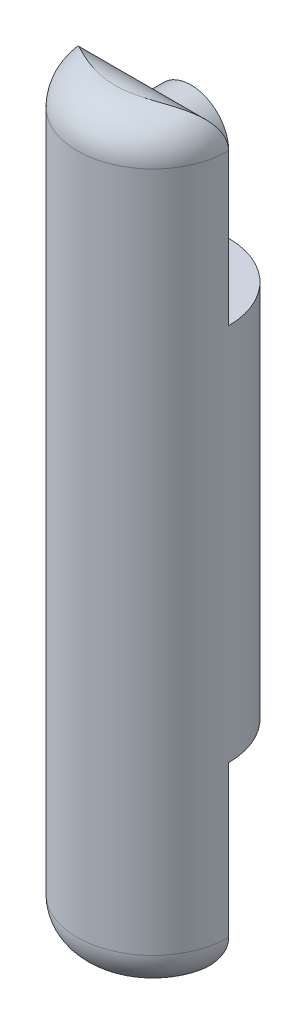
ISO-10303-21;
HEADER;
FILE_DESCRIPTION(('STEP AP214'),'2;1');
FILE_NAME('part.step','',(''),(''),'','','');
FILE_SCHEMA(('AUTOMOTIVE_DESIGN { 1 0 10303 214 1 1 1 1 }'));
ENDSEC;
DATA;
#1=APPLICATION_CONTEXT('core data for automotive mechanical design processes');
#2=APPLICATION_PROTOCOL_DEFINITION('international standard','automotive_design',2000,#1);
#3=PRODUCT_CONTEXT('',#1,'mechanical');
#4=PRODUCT('Part','Part','',(#3));
#5=PRODUCT_RELATED_PRODUCT_CATEGORY('part','',(#4));
#6=PRODUCT_DEFINITION_FORMATION('','',#4);
#7=PRODUCT_DEFINITION_CONTEXT('part definition',#1,'design');
#8=PRODUCT_DEFINITION('design','',#6,#7);
#9=PRODUCT_DEFINITION_SHAPE('','',#8);
#10=(LENGTH_UNIT() NAMED_UNIT(*) SI_UNIT(.MILLI.,.METRE.));
#11=(NAMED_UNIT(*) PLANE_ANGLE_UNIT() SI_UNIT($,.RADIAN.));
#12=(NAMED_UNIT(*) SI_UNIT($,.STERADIAN.) SOLID_ANGLE_UNIT());
#13=UNCERTAINTY_MEASURE_WITH_UNIT(LENGTH_MEASURE(1.E-05),#10,'distance_accuracy_value','');
#14=(GEOMETRIC_REPRESENTATION_CONTEXT(3) GLOBAL_UNCERTAINTY_ASSIGNED_CONTEXT((#13)) GLOBAL_UNIT_ASSIGNED_CONTEXT((#10,
#11,#12)) REPRESENTATION_CONTEXT('',''));
#15=CARTESIAN_POINT('',(0.,0.,0.));
#16=DIRECTION('',(0.,0.,1.));
#17=DIRECTION('',(1.,0.,0.));
#18=AXIS2_PLACEMENT_3D('',#15,#16,#17);
#19=CARTESIAN_POINT('',(0.,100.,0.));
#20=DIRECTION('',(0.,-1.,0.));
#21=DIRECTION('',(0.,0.,-1.));
#22=AXIS2_PLACEMENT_3D('',#19,#20,#21);
#23=CYLINDRICAL_SURFACE('',#22,10.);
#24=DIRECTION('',(0.,1.,0.));
#25=VECTOR('',#24,1.);
#26=CARTESIAN_POINT('',(10.,75.,0.));
#27=LINE('',#26,#25);
#28=CARTESIAN_POINT('',(10.,75.,0.));
#29=VERTEX_POINT('',#28);
#30=CARTESIAN_POINT('',(10.,95.,0.));
#31=VERTEX_POINT('',#30);
#32=EDGE_CURVE('E216',#29,#31,#27,.T.);
#33=ORIENTED_EDGE('',*,*,#32,.T.);
#34=CARTESIAN_POINT('',(0.,95.,0.));
#35=DIRECTION('',(0.,1.,0.));
#36=DIRECTION('',(0.,0.,1.));
#37=AXIS2_PLACEMENT_3D('',#34,#35,#36);
#38=CIRCLE('',#37,10.);
#39=CARTESIAN_POINT('',(-10.,95.,0.));
#40=VERTEX_POINT('',#39);
#41=EDGE_CURVE('E208',#31,#40,#38,.F.);
#42=ORIENTED_EDGE('',*,*,#41,.T.);
#43=DIRECTION('',(0.,-1.,0.));
#44=VECTOR('',#43,1.);
#45=CARTESIAN_POINT('',(-10.,75.,0.));
#46=LINE('',#45,#44);
#47=CARTESIAN_POINT('',(-10.,75.,0.));
#48=VERTEX_POINT('',#47);
#49=EDGE_CURVE('E224',#40,#48,#46,.T.);
#50=ORIENTED_EDGE('',*,*,#49,.T.);
#51=CARTESIAN_POINT('',(0.,75.,0.));
#52=DIRECTION('',(0.,-1.,0.));
#53=DIRECTION('',(0.,0.,-1.));
#54=AXIS2_PLACEMENT_3D('',#51,#52,#53);
#55=CIRCLE('',#54,10.);
#56=EDGE_CURVE('E212',#48,#29,#55,.T.);
#57=ORIENTED_EDGE('',*,*,#56,.T.);
#58=EDGE_LOOP('',(#33,#42,#50,#57));
#59=FACE_BOUND('',#58,.T.);
#60=DIRECTION('',(0.,1.,0.));
#61=VECTOR('',#60,1.);
#62=CARTESIAN_POINT('',(-10.,25.,0.));
#63=LINE('',#62,#61);
#64=CARTESIAN_POINT('',(-10.,4.99999999999998,0.));
#65=VERTEX_POINT('',#64);
#66=CARTESIAN_POINT('',(-10.,25.,0.));
#67=VERTEX_POINT('',#66);
#68=EDGE_CURVE('E240',#65,#67,#63,.T.);
#69=ORIENTED_EDGE('',*,*,#68,.F.);
#70=CARTESIAN_POINT('',(0.,4.99999999999998,0.));
#71=DIRECTION('',(0.,1.,0.));
#72=DIRECTION('',(0.,0.,1.));
#73=AXIS2_PLACEMENT_3D('',#70,#71,#72);
#74=CIRCLE('',#73,10.);
#75=CARTESIAN_POINT('',(10.,4.99999999999998,0.));
#76=VERTEX_POINT('',#75);
#77=EDGE_CURVE('E11',#65,#76,#74,.T.);
#78=ORIENTED_EDGE('',*,*,#77,.T.);
#79=DIRECTION('',(0.,-1.,0.));
#80=VECTOR('',#79,1.);
#81=CARTESIAN_POINT('',(10.,25.,0.));
#82=LINE('',#81,#80);
#83=CARTESIAN_POINT('',(10.,25.,0.));
#84=VERTEX_POINT('',#83);
#85=EDGE_CURVE('E237',#84,#76,#82,.T.);
#86=ORIENTED_EDGE('',*,*,#85,.F.);
#87=CARTESIAN_POINT('',(0.,25.,0.));
#88=DIRECTION('',(0.,-1.,0.));
#89=DIRECTION('',(0.,0.,-1.));
#90=AXIS2_PLACEMENT_3D('',#87,#88,#89);
#91=CIRCLE('',#90,10.);
#92=EDGE_CURVE('E107',#67,#84,#91,.T.);
#93=ORIENTED_EDGE('',*,*,#92,.F.);
#94=EDGE_LOOP('',(#69,#78,#86,#93));
#95=FACE_BOUND('',#94,.T.);
#96=ADVANCED_FACE('F45',(#59,#95),#23,.T.);
#97=CARTESIAN_POINT('',(10.,75.,-10.));
#98=DIRECTION('',(0.,-1.,0.));
#99=DIRECTION('',(0.,0.,-1.));
#100=AXIS2_PLACEMENT_3D('',#97,#98,#99);
#101=PLANE('',#100);
#102=ORIENTED_EDGE('',*,*,#56,.F.);
#103=DIRECTION('',(1.,0.,0.));
#104=VECTOR('',#103,1.);
#105=CARTESIAN_POINT('',(10.,75.,0.));
#106=LINE('',#105,#104);
#107=EDGE_CURVE('E220',#48,#29,#106,.T.);
#108=ORIENTED_EDGE('',*,*,#107,.T.);
#109=EDGE_LOOP('',(#102,#108));
#110=FACE_BOUND('',#109,.T.);
#111=ADVANCED_FACE('F256',(#110),#101,.F.);
#112=CARTESIAN_POINT('',(0.,0.,0.));
#113=DIRECTION('',(0.,0.,1.));
#114=DIRECTION('',(1.,0.,0.));
#115=AXIS2_PLACEMENT_3D('',#112,#113,#114);
#116=PLANE('',#115);
#117=ORIENTED_EDGE('',*,*,#49,.F.);
#118=DIRECTION('',(-1.,0.,0.));
#119=VECTOR('',#118,1.);
#120=CARTESIAN_POINT('',(10.,95.,0.));
#121=LINE('',#120,#119);
#122=CARTESIAN_POINT('',(-0.812574400381942,95.,0.));
#123=VERTEX_POINT('',#122);
#124=EDGE_CURVE('E202',#40,#123,#121,.F.);
#125=ORIENTED_EDGE('',*,*,#124,.T.);
#126=CARTESIAN_POINT('',(0.,90.066469535531,0.));
#127=DIRECTION('',(0.,0.,1.));
#128=DIRECTION('',(1.,0.,0.));
#129=AXIS2_PLACEMENT_3D('',#126,#127,#128);
#130=CIRCLE('',#129,5.);
#131=CARTESIAN_POINT('',(0.812574400381942,95.,0.));
#132=VERTEX_POINT('',#131);
#133=EDGE_CURVE('E159',#123,#132,#130,.T.);
#134=ORIENTED_EDGE('',*,*,#133,.T.);
#135=DIRECTION('',(-1.,0.,0.));
#136=VECTOR('',#135,1.);
#137=CARTESIAN_POINT('',(10.,95.,0.));
#138=LINE('',#137,#136);
#139=EDGE_CURVE('E205',#132,#31,#138,.F.);
#140=ORIENTED_EDGE('',*,*,#139,.T.);
#141=ORIENTED_EDGE('',*,*,#32,.F.);
#142=ORIENTED_EDGE('',*,*,#107,.F.);
#143=EDGE_LOOP('',(#117,#125,#134,#140,#141,#142));
#144=FACE_BOUND('',#143,.T.);
#145=ADVANCED_FACE('F193',(#144),#116,.F.);
#146=CARTESIAN_POINT('',(0.,90.066469535531,-5.));
#147=DIRECTION('',(0.,0.,1.));
#148=DIRECTION('',(1.,0.,0.));
#149=AXIS2_PLACEMENT_3D('',#146,#147,#148);
#150=CYLINDRICAL_SURFACE('',#149,5.);
#151=CARTESIAN_POINT('',(0.,90.066469535531,-5.));
#152=DIRECTION('',(0.,0.,1.));
#153=DIRECTION('',(1.,0.,0.));
#154=AXIS2_PLACEMENT_3D('',#151,#152,#153);
#155=CIRCLE('',#154,5.);
#156=CARTESIAN_POINT('',(5.,90.066469535531,-5.));
#157=VERTEX_POINT('',#156);
#158=EDGE_CURVE('E227',#157,#157,#155,.T.);
#159=ORIENTED_EDGE('',*,*,#158,.T.);
#160=EDGE_LOOP('',(#159));
#161=FACE_BOUND('',#160,.T.);
#162=ORIENTED_EDGE('',*,*,#133,.F.);
#163=CARTESIAN_POINT('',(-0.812574400381942,95.,0.));
#164=CARTESIAN_POINT('',(-0.67790557342769,95.0221930891362,3.66883130780384E-05));
#165=CARTESIAN_POINT('',(-0.542326520837233,95.0388472944748,0.000147760704351347));
#166=CARTESIAN_POINT('',(-0.271160991618298,95.0609488182908,0.000350273768121055));
#167=CARTESIAN_POINT('',(-0.135580495809148,95.066469535531,0.000441839434129433));
#168=CARTESIAN_POINT('',(0.13558049580915,95.066469535531,0.000441839434129461));
#169=CARTESIAN_POINT('',(0.2711609916183,95.0609488182908,0.00035027376812111));
#170=CARTESIAN_POINT('',(0.542326520837235,95.0388472944748,0.000147760704351463));
#171=CARTESIAN_POINT('',(0.677905573427692,95.0221930891362,3.66883130781877E-05));
#172=CARTESIAN_POINT('',(0.812574400381944,95.,0.));
#173=B_SPLINE_CURVE_WITH_KNOTS('',3,(#163,#164,#165,#166,#167,#168,#169,#170,#171,#172),
.UNSPECIFIED.,.F.,.F.,(4,2,2,2,4),(0.,0.409337772377737,0.815968000251602,1.22259822812547,
1.6319360005032),.UNSPECIFIED.);
#174=EDGE_CURVE('E163',#123,#132,#173,.T.);
#175=ORIENTED_EDGE('',*,*,#174,.T.);
#176=EDGE_LOOP('',(#162,#175));
#177=FACE_BOUND('',#176,.T.);
#178=ADVANCED_FACE('F188',(#161,#177),#150,.T.);
#179=CARTESIAN_POINT('',(0.,90.066469535531,-5.));
#180=DIRECTION('',(0.,0.,1.));
#181=DIRECTION('',(1.,0.,0.));
#182=AXIS2_PLACEMENT_3D('',#179,#180,#181);
#183=PLANE('',#182);
#184=ORIENTED_EDGE('',*,*,#158,.F.);
#185=EDGE_LOOP('',(#184));
#186=FACE_BOUND('',#185,.T.);
#187=ADVANCED_FACE('F185',(#186),#183,.F.);
#188=CARTESIAN_POINT('',(0.,95.,5.));
#189=DIRECTION('',(1.,0.,0.));
#190=DIRECTION('',(0.,0.,-1.));
#191=AXIS2_PLACEMENT_3D('',#188,#189,#190);
#192=CYLINDRICAL_SURFACE('',#191,5.);
#193=ORIENTED_EDGE('',*,*,#174,.F.);
#194=ORIENTED_EDGE('',*,*,#124,.F.);
#195=CARTESIAN_POINT('',(-10.,95.,0.));
#196=CARTESIAN_POINT('',(-10.0000186621462,95.109481128906,-2.67095448372106E-05));
#197=CARTESIAN_POINT('',(-9.99640510464395,95.2189487809777,0.00359468229512016));
#198=CARTESIAN_POINT('',(-9.98205407947085,95.436887226979,0.0179345321929953));
#199=CARTESIAN_POINT('',(-9.97132069824936,95.5453585565659,0.0286489191928138));
#200=CARTESIAN_POINT('',(-9.94296936316064,95.7597128234585,0.0568773691555696));
#201=CARTESIAN_POINT('',(-9.9253998926326,95.8656085286161,0.0743435411466067));
#202=CARTESIAN_POINT('',(-9.88362272288509,96.0748003444367,0.115722034743118));
#203=CARTESIAN_POINT('',(-9.85941439914113,96.178096209531,0.139634962798709));
#204=CARTESIAN_POINT('',(-9.80472959176057,96.3811629860674,0.193401065176742));
#205=CARTESIAN_POINT('',(-9.77426730480449,96.4809412916891,0.223240780610438));
#206=CARTESIAN_POINT('',(-9.707403231472,96.6766699717462,0.28837204733803));
#207=CARTESIAN_POINT('',(-9.67099881241379,96.7726186258839,0.323666014786202));
#208=CARTESIAN_POINT('',(-9.5533328841649,97.0542415608907,0.436999216654399));
#209=CARTESIAN_POINT('',(-9.46365532149096,97.2335590300103,0.522453277561387));
#210=CARTESIAN_POINT('',(-9.29879424318218,97.5153010191273,0.676836950648343));
#211=CARTESIAN_POINT('',(-9.22891680346262,97.6232678349325,0.741625025645634));
#212=CARTESIAN_POINT('',(-9.08164924199558,97.8304836258159,0.876454251929069));
#213=CARTESIAN_POINT('',(-9.00425709687325,97.9297302391538,0.946496816854011));
#214=CARTESIAN_POINT('',(-8.76185518300568,98.2144481017106,1.16279508776863));
#215=CARTESIAN_POINT('',(-8.5866781068222,98.3868001635109,1.31516605491869));
#216=CARTESIAN_POINT('',(-8.27203822653394,98.6501577584139,1.57950470468883));
#217=CARTESIAN_POINT('',(-8.13803760630387,98.7499210627327,1.68957734990039));
#218=CARTESIAN_POINT('',(-7.86104722004844,98.9344377621682,1.91115476753484));
#219=CARTESIAN_POINT('',(-7.71805401740357,99.0191853710499,2.0226600743532));
#220=CARTESIAN_POINT('',(-7.42409710519104,99.174886719524,2.24522141218175));
#221=CARTESIAN_POINT('',(-7.27312197218609,99.2458199696341,2.35627654017932));
#222=CARTESIAN_POINT('',(-6.96431462329925,99.3750429806096,2.57610843955653));
#223=CARTESIAN_POINT('',(-6.8064826711737,99.4333332272884,2.68488529833457));
#224=CARTESIAN_POINT('',(-6.4333751897412,99.5553855198772,2.93283423400923));
#225=CARTESIAN_POINT('',(-6.21582430709963,99.6149701922133,3.07064395790101));
#226=CARTESIAN_POINT('',(-5.77134687809699,99.7175177765771,3.3370492171827));
#227=CARTESIAN_POINT('',(-5.54441734026438,99.7604753391232,3.46564177628678));
#228=CARTESIAN_POINT('',(-5.08241188023016,99.8327165244243,3.71112074230516));
#229=CARTESIAN_POINT('',(-4.84734108268232,99.8620085869544,3.82801433933006));
#230=CARTESIAN_POINT('',(-4.36990210844634,99.9098326852446,4.04804635997963));
#231=CARTESIAN_POINT('',(-4.12753655342137,99.9283685392358,4.15118965464965));
#232=CARTESIAN_POINT('',(-3.63869429345518,99.9572960234078,4.34095196067851));
#233=CARTESIAN_POINT('',(-3.39228155020723,99.9677660337299,4.42772365063253));
#234=CARTESIAN_POINT('',(-2.89421757355262,99.9833068989249,4.5842745680929));
#235=CARTESIAN_POINT('',(-2.64257154616481,99.9883828802061,4.65406988096091));
#236=CARTESIAN_POINT('',(-2.07767772316836,99.996106694137,4.78899146958065));
#237=CARTESIAN_POINT('',(-1.76330130773517,99.9979519341869,4.84953927754232));
#238=CARTESIAN_POINT('',(-1.24917414857425,99.999499250028,4.92393586920952));
#239=CARTESIAN_POINT('',(-1.05068743231913,99.9997457724766,4.94678266441202));
#240=CARTESIAN_POINT('',(-0.72996052556808,99.9999435027498,4.97409886461233));
#241=CARTESIAN_POINT('',(-0.608031310894953,99.9999721984027,4.98225936203668));
#242=CARTESIAN_POINT('',(-0.413828993335563,99.9999942465566,4.99169777967294));
#243=CARTESIAN_POINT('',(-0.341624193407272,99.999997249708,4.99442549880829));
#244=CARTESIAN_POINT('',(-0.212942289660993,99.9999998037038,4.99789212412415));
#245=CARTESIAN_POINT('',(-0.15647337716182,99.999999965158,4.9989352311098));
#246=CARTESIAN_POINT('',(-0.0666676462309068,99.9999999808091,4.99983334427297));
#247=CARTESIAN_POINT('',(-0.0333337370939474,99.9999999338005,5.00000004848213));
#248=CARTESIAN_POINT('',(0.,100.,5.00000000000003));
#249=B_SPLINE_CURVE_WITH_KNOTS('',3,(#195,#196,#197,#198,#199,#200,#201,#202,#203,#204,#205,
#206,#207,#208,#209,#210,#211,#212,#213,#214,#215,#216,#217,#218,#219,#220,#221,#222,#223,#224,
#225,#226,#227,#228,#229,#230,#231,#232,#233,#234,#235,#236,#237,#238,#239,#240,#241,#242,#243,
#244,#245,#246,#247,#248),.UNSPECIFIED.,.F.,.F.,(4,2,2,2,2,2,2,2,2,2,2,2,2,2,2,2,2,2,2,2,2,2,2,
2,2,2,4),(0.,0.328302730117657,0.656417192510453,0.982245796518992,1.30810506211666,
1.63323263819663,1.95850465611579,2.60947408305884,3.04098213308044,3.47260669285976,
4.33622925737949,4.93572989894279,5.53546105549433,6.13607507084202,6.73666600322207,
7.52867879459255,8.32094619082361,9.1127236350197,9.90421984242299,10.6879240924535,
11.4708828531573,12.4298889508044,13.0289555962828,13.3954793452464,13.612232508259,
13.7816597364275,13.8816609864198),.UNSPECIFIED.);
#250=CARTESIAN_POINT('',(0.,100.,5.));
#251=VERTEX_POINT('',#250);
#252=EDGE_CURVE('E152',#251,#40,#249,.F.);
#253=ORIENTED_EDGE('',*,*,#252,.F.);
#254=CARTESIAN_POINT('',(0.,100.,5.00000000000003));
#255=CARTESIAN_POINT('',(0.0333342246904434,99.9999999919485,5.00000000062013));
#256=CARTESIAN_POINT('',(0.0666679318382451,100.000000009193,4.99983331950454));
#257=CARTESIAN_POINT('',(0.11194429202892,99.9999999627472,4.99938055749996));
#258=CARTESIAN_POINT('',(0.123888373596873,99.9999999438894,4.99923971709066));
#259=CARTESIAN_POINT('',(0.183608620272589,99.9999997989185,4.99842851985548));
#260=CARTESIAN_POINT('',(0.231380854224731,99.9999995207598,4.99743720782266));
#261=CARTESIAN_POINT('',(0.327822840911283,99.9999974234562,4.99474509388247));
#262=CARTESIAN_POINT('',(0.376492223332792,99.9999955748401,4.99303104100167));
#263=CARTESIAN_POINT('',(0.450934898986961,99.9999898487715,4.98986613856566));
#264=CARTESIAN_POINT('',(0.476719305099431,99.9999873330636,4.98867015770637));
#265=CARTESIAN_POINT('',(0.605628485689679,99.9999709676357,4.9821925199474));
#266=CARTESIAN_POINT('',(0.708680289859203,99.9999457589226,4.97541903753608));
#267=CARTESIAN_POINT('',(1.01784248879754,99.9997828571157,4.95032502497093));
#268=CARTESIAN_POINT('',(1.22358537445785,99.9995576640486,4.92723825641113));
#269=CARTESIAN_POINT('',(1.63342690119004,99.9983600344552,4.86869876846174));
#270=CARTESIAN_POINT('',(1.83752419911383,99.9973870398291,4.83323682401451));
#271=CARTESIAN_POINT('',(2.34405286043905,99.9930875369004,4.72987559488323));
#272=CARTESIAN_POINT('',(2.64500081144544,99.9888324467156,4.65461280939048));
#273=CARTESIAN_POINT('',(3.23969663258352,99.9736216406297,4.47964559384549));
#274=CARTESIAN_POINT('',(3.53343942059888,99.9626613290149,4.37992442829221));
#275=CARTESIAN_POINT('',(4.11257118853161,99.9299576254203,4.15853862402556));
#276=CARTESIAN_POINT('',(4.3979428378552,99.9081933343874,4.03683174788168));
#277=CARTESIAN_POINT('',(4.95831241644302,99.8493945392217,3.77468044275884));
#278=CARTESIAN_POINT('',(5.23331220221517,99.8123627821781,3.63423938771124));
#279=CARTESIAN_POINT('',(5.70277195713379,99.7303037813628,3.37592942545357));
#280=CARTESIAN_POINT('',(5.89988110128237,99.6897263547158,3.26144223521077));
#281=CARTESIAN_POINT('',(6.28681434994671,99.5954477346053,3.02566911424512));
#282=CARTESIAN_POINT('',(6.47663821465877,99.5417461095711,2.904382960049));
#283=CARTESIAN_POINT('',(6.84763717279321,99.4193105142843,2.657209181453));
#284=CARTESIAN_POINT('',(7.02883169395037,99.3506124651626,2.53133314136388));
#285=CARTESIAN_POINT('',(7.38184229370282,99.196104710065,2.27697873907008));
#286=CARTESIAN_POINT('',(7.55365964047622,99.1102973253128,2.14850073199631));
#287=CARTESIAN_POINT('',(7.95008958438294,98.8831364050198,1.84244258513636));
#288=CARTESIAN_POINT('',(8.16983186428416,98.7330812496108,1.66483209803055));
#289=CARTESIAN_POINT('',(8.58323482390857,98.3920074196377,1.31853681797523));
#290=CARTESIAN_POINT('',(8.77692328366495,98.2010329482229,1.14984263640582));
#291=CARTESIAN_POINT('',(9.09285473514287,97.8215872031395,0.866968422252701));
#292=CARTESIAN_POINT('',(9.22150334687803,97.641418327926,0.748868635196722));
#293=CARTESIAN_POINT('',(9.45380103481113,97.2551100622395,0.531956521522456));
#294=CARTESIAN_POINT('',(9.55747462820606,97.0489964461161,0.433125297884917));
#295=CARTESIAN_POINT('',(9.72154772342875,96.6469157285514,0.274861264411679));
#296=CARTESIAN_POINT('',(9.78612438703671,96.4541451985123,0.211727452652631));
#297=CARTESIAN_POINT('',(9.86474352404259,96.1559755637524,0.134375287583743));
#298=CARTESIAN_POINT('',(9.88790464516985,96.0551154874339,0.111486992878856));
#299=CARTESIAN_POINT('',(9.92790705749827,95.8509772906148,0.0718531712626069));
#300=CARTESIAN_POINT('',(9.94475070771367,95.7477000880317,0.0551053514818556));
#301=CARTESIAN_POINT('',(9.97214835117934,95.5374817981561,0.0278229570266679));
#302=CARTESIAN_POINT('',(9.98257742794377,95.4305083559682,0.0174118201305885));
#303=CARTESIAN_POINT('',(9.99651089353284,95.2156944435843,0.00348892643664454));
#304=CARTESIAN_POINT('',(10.0000170188917,95.1078541976313,-2.4560547630878E-05));
#305=CARTESIAN_POINT('',(10.,95.,0.));
#306=B_SPLINE_CURVE_WITH_KNOTS('',3,(#254,#255,#256,#257,#258,#259,#260,#261,#262,#263,#264,
#265,#266,#267,#268,#269,#270,#271,#272,#273,#274,#275,#276,#277,#278,#279,#280,#281,#282,#283,
#284,#285,#286,#287,#288,#289,#290,#291,#292,#293,#294,#295,#296,#297,#298,#299,#300,#301,#302,
#303,#304,#305),.UNSPECIFIED.,.F.,.F.,(4,2,2,2,2,2,2,2,2,2,2,2,2,2,2,2,2,2,2,2,2,2,2,2,2,4),(0.,
0.100001249992197,0.135835934097826,0.279178118292439,0.42527123528673,0.502707092721602,
0.812484968795602,1.43316188447759,2.05430247475667,2.98380240403824,3.9139401211723,
4.84588413513619,5.77766053669958,6.47173074753722,7.16582378496708,7.85827214717592,
8.55062662875167,9.50715874425213,10.462662727695,11.2125799031296,11.9617578806476,
12.59739247633,12.9150162436145,13.2325212882739,13.5560283356812,13.8794542251495),.UNSPECIFIED.);
#307=EDGE_CURVE('E145',#31,#251,#306,.F.);
#308=ORIENTED_EDGE('',*,*,#307,.F.);
#309=ORIENTED_EDGE('',*,*,#139,.F.);
#310=EDGE_LOOP('',(#193,#194,#253,#308,#309));
#311=FACE_BOUND('',#310,.T.);
#312=ADVANCED_FACE('F139',(#311),#192,.T.);
#313=CARTESIAN_POINT('',(0.,95.,0.));
#314=DIRECTION('',(0.,1.,0.));
#315=DIRECTION('',(0.,0.,1.));
#316=AXIS2_PLACEMENT_3D('',#313,#314,#315);
#317=DEGENERATE_TOROIDAL_SURFACE('',#316,5.,5.,.T.);
#318=ORIENTED_EDGE('',*,*,#252,.T.);
#319=ORIENTED_EDGE('',*,*,#41,.F.);
#320=ORIENTED_EDGE('',*,*,#307,.T.);
#321=EDGE_LOOP('',(#318,#319,#320));
#322=FACE_BOUND('',#321,.T.);
#323=ADVANCED_FACE('F133',(#322),#317,.T.);
#324=CARTESIAN_POINT('',(10.,25.,-10.));
#325=DIRECTION('',(0.,-1.,0.));
#326=DIRECTION('',(0.,0.,-1.));
#327=AXIS2_PLACEMENT_3D('',#324,#325,#326);
#328=PLANE('',#327);
#329=ORIENTED_EDGE('',*,*,#92,.T.);
#330=DIRECTION('',(1.,0.,0.));
#331=VECTOR('',#330,1.);
#332=CARTESIAN_POINT('',(10.,25.,0.));
#333=LINE('',#332,#331);
#334=EDGE_CURVE('E234',#67,#84,#333,.T.);
#335=ORIENTED_EDGE('',*,*,#334,.F.);
#336=EDGE_LOOP('',(#329,#335));
#337=FACE_BOUND('',#336,.T.);
#338=ADVANCED_FACE('F138',(#337),#328,.T.);
#339=CARTESIAN_POINT('',(0.,100.,0.));
#340=DIRECTION('',(0.,0.,1.));
#341=DIRECTION('',(1.,0.,0.));
#342=AXIS2_PLACEMENT_3D('',#339,#340,#341);
#343=PLANE('',#342);
#344=ORIENTED_EDGE('',*,*,#85,.T.);
#345=DIRECTION('',(-1.,0.,0.));
#346=VECTOR('',#345,1.);
#347=CARTESIAN_POINT('',(0.,5.,0.));
#348=LINE('',#347,#346);
#349=CARTESIAN_POINT('',(0.812574400382033,5.,0.));
#350=VERTEX_POINT('',#349);
#351=EDGE_CURVE('E118',#76,#350,#348,.T.);
#352=ORIENTED_EDGE('',*,*,#351,.T.);
#353=CARTESIAN_POINT('',(0.,9.93353046446902,0.));
#354=DIRECTION('',(0.,0.,1.));
#355=DIRECTION('',(1.,0.,0.));
#356=AXIS2_PLACEMENT_3D('',#353,#354,#355);
#357=CIRCLE('',#356,5.);
#358=CARTESIAN_POINT('',(-0.812574400382033,5.,0.));
#359=VERTEX_POINT('',#358);
#360=EDGE_CURVE('E121',#350,#359,#357,.T.);
#361=ORIENTED_EDGE('',*,*,#360,.T.);
#362=DIRECTION('',(-1.,0.,0.));
#363=VECTOR('',#362,1.);
#364=CARTESIAN_POINT('',(0.,5.,0.));
#365=LINE('',#364,#363);
#366=EDGE_CURVE('E162',#359,#65,#365,.T.);
#367=ORIENTED_EDGE('',*,*,#366,.T.);
#368=ORIENTED_EDGE('',*,*,#68,.T.);
#369=ORIENTED_EDGE('',*,*,#334,.T.);
#370=EDGE_LOOP('',(#344,#352,#361,#367,#368,#369));
#371=FACE_BOUND('',#370,.T.);
#372=ADVANCED_FACE('F178',(#371),#343,.F.);
#373=CARTESIAN_POINT('',(0.,9.93353046446902,5.));
#374=DIRECTION('',(0.,0.,-1.));
#375=DIRECTION('',(-1.,0.,0.));
#376=AXIS2_PLACEMENT_3D('',#373,#374,#375);
#377=CYLINDRICAL_SURFACE('',#376,5.);
#378=CARTESIAN_POINT('',(0.,9.93353046446902,5.));
#379=DIRECTION('',(0.,0.,1.));
#380=DIRECTION('',(1.,0.,0.));
#381=AXIS2_PLACEMENT_3D('',#378,#379,#380);
#382=CIRCLE('',#381,5.);
#383=CARTESIAN_POINT('',(5.,9.93353046446902,5.));
#384=VERTEX_POINT('',#383);
#385=EDGE_CURVE('E243',#384,#384,#382,.T.);
#386=ORIENTED_EDGE('',*,*,#385,.T.);
#387=EDGE_LOOP('',(#386));
#388=FACE_BOUND('',#387,.T.);
#389=ORIENTED_EDGE('',*,*,#360,.F.);
#390=CARTESIAN_POINT('',(0.812574400382033,5.,0.));
#391=CARTESIAN_POINT('',(0.677905573427767,4.9778069108638,3.66883130779067E-05));
#392=CARTESIAN_POINT('',(0.542326520837294,4.96115270552516,0.000147760704351183));
#393=CARTESIAN_POINT('',(0.271160991618329,4.93905118170922,0.000350273768120873));
#394=CARTESIAN_POINT('',(0.135580495809164,4.93353046446901,0.000441839434129264));
#395=CARTESIAN_POINT('',(-0.135580495809165,4.93353046446901,0.000441839434129214));
#396=CARTESIAN_POINT('',(-0.271160991618329,4.93905118170922,0.000350273768120773));
#397=CARTESIAN_POINT('',(-0.542326520837294,4.96115270552516,0.000147760704350984));
#398=CARTESIAN_POINT('',(-0.677905573427767,4.9778069108638,3.66883130776581E-05));
#399=CARTESIAN_POINT('',(-0.812574400382033,5.00000000000001,0.));
#400=B_SPLINE_CURVE_WITH_KNOTS('',3,(#390,#391,#392,#393,#394,#395,#396,#397,#398,#399),
.UNSPECIFIED.,.F.,.F.,(4,2,2,2,4),(0.,0.409337772377784,0.815968000251694,1.2225982281256,
1.63193600050339),.UNSPECIFIED.);
#401=EDGE_CURVE('E61',#350,#359,#400,.T.);
#402=ORIENTED_EDGE('',*,*,#401,.T.);
#403=EDGE_LOOP('',(#389,#402));
#404=FACE_BOUND('',#403,.T.);
#405=ADVANCED_FACE('F173',(#388,#404),#377,.F.);
#406=CARTESIAN_POINT('',(0.,9.93353046446902,5.));
#407=DIRECTION('',(0.,0.,1.));
#408=DIRECTION('',(1.,0.,0.));
#409=AXIS2_PLACEMENT_3D('',#406,#407,#408);
#410=PLANE('',#409);
#411=ORIENTED_EDGE('',*,*,#385,.F.);
#412=EDGE_LOOP('',(#411));
#413=FACE_BOUND('',#412,.T.);
#414=ADVANCED_FACE('F132',(#413),#410,.F.);
#415=CARTESIAN_POINT('',(0.,5.,0.));
#416=DIRECTION('',(0.,1.,0.));
#417=DIRECTION('',(0.,0.,1.));
#418=AXIS2_PLACEMENT_3D('',#415,#416,#417);
#419=DEGENERATE_TOROIDAL_SURFACE('',#418,5.,5.,.T.);
#420=CARTESIAN_POINT('',(0.,0.,5.00000000000003));
#421=CARTESIAN_POINT('',(0.0333342246904454,8.05146995597153E-09,5.0000000006201));
#422=CARTESIAN_POINT('',(0.0666679318382503,-9.19288872753277E-09,4.99983331950453));
#423=CARTESIAN_POINT('',(0.111944292028923,3.72527662451889E-08,4.99938055749996));
#424=CARTESIAN_POINT('',(0.123888373596871,5.61105470790103E-08,4.99923971709066));
#425=CARTESIAN_POINT('',(0.18360862027256,2.01081495268737E-07,4.99842851985547));
#426=CARTESIAN_POINT('',(0.231380854224678,4.79240227690847E-07,4.9974372078226));
#427=CARTESIAN_POINT('',(0.327822840911183,2.57654382951673E-06,4.99474509388253));
#428=CARTESIAN_POINT('',(0.37649222333267,4.42515988476219E-06,4.99303104100191));
#429=CARTESIAN_POINT('',(0.450934898986761,1.01512285160947E-05,4.98986613856591));
#430=CARTESIAN_POINT('',(0.476719305099183,1.26669363584032E-05,4.98867015770657));
#431=CARTESIAN_POINT('',(0.605628485689189,2.9032364293388E-05,4.98219251994743));
#432=CARTESIAN_POINT('',(0.708680289858526,5.42410773670138E-05,4.97541903753613));
#433=CARTESIAN_POINT('',(1.0178424887963,0.000217142884288431,4.95032502497105));
#434=CARTESIAN_POINT('',(1.22358537445623,0.000442335951445316,4.92723825641131));
#435=CARTESIAN_POINT('',(1.6334269011877,0.00163996554475022,4.8686987684621));
#436=CARTESIAN_POINT('',(1.83752419911113,0.00261296017092934,4.833236824015));
#437=CARTESIAN_POINT('',(2.34405286043598,0.00691246309956792,4.72987559488397));
#438=CARTESIAN_POINT('',(2.64500081144236,0.0111675532843241,4.6546128093913));
#439=CARTESIAN_POINT('',(3.23969663258044,0.0263783593701734,4.47964559384649));
#440=CARTESIAN_POINT('',(3.5334394205958,0.0373386709849544,4.3799244282933));
#441=CARTESIAN_POINT('',(4.11257118852854,0.0700423745794425,4.15853862402683));
#442=CARTESIAN_POINT('',(4.39794283785214,0.091806665612354,4.03683174788302));
#443=CARTESIAN_POINT('',(4.95831241643998,0.150605460777878,3.77468044276035));
#444=CARTESIAN_POINT('',(5.23331220221214,0.187637217821468,3.63423938771282));
#445=CARTESIAN_POINT('',(5.70277195713093,0.269696218636654,3.37592942545521));
#446=CARTESIAN_POINT('',(5.89988110127964,0.310273645283636,3.26144223521239));
#447=CARTESIAN_POINT('',(6.28681434994424,0.404552265394049,3.02566911424667));
#448=CARTESIAN_POINT('',(6.47663821465643,0.458253890428244,2.90438296005052));
#449=CARTESIAN_POINT('',(6.84763717279113,0.580689485714954,2.65720918145443));
#450=CARTESIAN_POINT('',(7.02883169394841,0.649387534836635,2.53133314136526));
#451=CARTESIAN_POINT('',(7.3818422937011,0.803895289934214,2.27697873907135));
#452=CARTESIAN_POINT('',(7.55365964047462,0.889702674686373,2.14850073199751));
#453=CARTESIAN_POINT('',(7.95008958438155,1.11686359497933,1.84244258513746));
#454=CARTESIAN_POINT('',(8.16983186428287,1.26691875038824,1.6648320980316));
#455=CARTESIAN_POINT('',(8.58323482390747,1.60799258036126,1.31853681797617));
#456=CARTESIAN_POINT('',(8.77692328366396,1.79896705177608,1.1498426364067));
#457=CARTESIAN_POINT('',(9.09285473514204,2.17841279685943,0.866968422253452));
#458=CARTESIAN_POINT('',(9.22150334687727,2.35858167207286,0.748868635197416));
#459=CARTESIAN_POINT('',(9.45380103481053,2.74488993775941,0.531956521523027));
#460=CARTESIAN_POINT('',(9.55747462820553,2.95100355388279,0.433125297885423));
#461=CARTESIAN_POINT('',(9.72154772342835,3.35308427144748,0.274861264412074));
#462=CARTESIAN_POINT('',(9.78612438703636,3.54585480148652,0.211727452652978));
#463=CARTESIAN_POINT('',(9.86474352404232,3.84402443624639,0.134375287584017));
#464=CARTESIAN_POINT('',(9.88790464516959,3.94488451256498,0.111486992879105));
#465=CARTESIAN_POINT('',(9.92790705749807,4.14902270938404,0.0718531712628055));
#466=CARTESIAN_POINT('',(9.9447507077135,4.25229991196711,0.0551053514820287));
#467=CARTESIAN_POINT('',(9.97214835117924,4.46251820184299,0.0278229570267672));
#468=CARTESIAN_POINT('',(9.98257742794371,4.56949164403105,0.0174118201306506));
#469=CARTESIAN_POINT('',(9.99651089353283,4.7843055564153,0.00348892643665679));
#470=CARTESIAN_POINT('',(10.0000170188917,4.8921458023685,-2.45605476312469E-05));
#471=CARTESIAN_POINT('',(10.,4.99999999999998,0.));
#472=B_SPLINE_CURVE_WITH_KNOTS('',3,(#420,#421,#422,#423,#424,#425,#426,#427,#428,#429,#430,
#431,#432,#433,#434,#435,#436,#437,#438,#439,#440,#441,#442,#443,#444,#445,#446,#447,#448,#449,
#450,#451,#452,#453,#454,#455,#456,#457,#458,#459,#460,#461,#462,#463,#464,#465,#466,#467,#468,
#469,#470,#471),.UNSPECIFIED.,.F.,.F.,(4,2,2,2,2,2,2,2,2,2,2,2,2,2,2,2,2,2,2,2,2,2,2,2,2,4),(0.,
0.100001249992205,0.135835934097818,0.279178118292367,0.425271235286569,0.502707092721301,
0.812484968794741,1.4331618844756,2.05430247475356,2.98380240403503,3.91394012116901,
4.84588413513281,5.77766053669612,6.47173074753412,7.16582378496432,7.85827214717352,
8.55062662874963,9.50715874425031,10.4626627276934,11.2125799031282,11.9617578806463,
12.5973924763288,12.9150162436133,13.2325212882728,13.5560283356806,13.8794542251495),.UNSPECIFIED.);
#473=CARTESIAN_POINT('',(0.,0.,5.));
#474=VERTEX_POINT('',#473);
#475=EDGE_CURVE('E50',#76,#474,#472,.F.);
#476=ORIENTED_EDGE('',*,*,#475,.F.);
#477=ORIENTED_EDGE('',*,*,#77,.F.);
#478=CARTESIAN_POINT('',(-10.,4.99999999999998,0.));
#479=CARTESIAN_POINT('',(-10.0000186621462,4.89051887109397,-2.67095448359801E-05));
#480=CARTESIAN_POINT('',(-9.99640510464395,4.7810512190223,0.00359468229512212));
#481=CARTESIAN_POINT('',(-9.98205407947084,4.56311277302091,0.0179345321929986));
#482=CARTESIAN_POINT('',(-9.97132069824936,4.45464144343408,0.0286489191928179));
#483=CARTESIAN_POINT('',(-9.94296936316064,4.24028717654142,0.0568773691555757));
#484=CARTESIAN_POINT('',(-9.92539989263259,4.13439147138381,0.0743435411466135));
#485=CARTESIAN_POINT('',(-9.88362272288508,3.92519965556331,0.115722034743125));
#486=CARTESIAN_POINT('',(-9.85941439914112,3.82190379046895,0.139634962798715));
#487=CARTESIAN_POINT('',(-9.80472959176057,3.61883701393261,0.193401065176748));
#488=CARTESIAN_POINT('',(-9.77426730480448,3.51905870831086,0.223240780610445));
#489=CARTESIAN_POINT('',(-9.70740323147199,3.32333002825381,0.288372047338037));
#490=CARTESIAN_POINT('',(-9.67099881241378,3.22738137411612,0.323666014786209));
#491=CARTESIAN_POINT('',(-9.55333288416488,2.94575843910928,0.436999216654408));
#492=CARTESIAN_POINT('',(-9.46365532149095,2.76644096998962,0.522453277561399));
#493=CARTESIAN_POINT('',(-9.29879424318216,2.48469898087267,0.67683695064836));
#494=CARTESIAN_POINT('',(-9.2289168034626,2.37673216506748,0.741625025645652));
#495=CARTESIAN_POINT('',(-9.08164924199556,2.16951637418404,0.876454251929088));
#496=CARTESIAN_POINT('',(-9.00425709687323,2.07026976084613,0.94649681685403));
#497=CARTESIAN_POINT('',(-8.76185518300565,1.7855518982894,1.16279508776866));
#498=CARTESIAN_POINT('',(-8.58667810682217,1.61319983648911,1.31516605491871));
#499=CARTESIAN_POINT('',(-8.27203822653391,1.34984224158606,1.57950470468886));
#500=CARTESIAN_POINT('',(-8.13803760630383,1.25007893726729,1.68957734990042));
#501=CARTESIAN_POINT('',(-7.86104722004839,1.06556223783178,1.91115476753488));
#502=CARTESIAN_POINT('',(-7.71805401740353,0.980814628950085,2.02266007435324));
#503=CARTESIAN_POINT('',(-7.424097105191,0.825113280475993,2.24522141218179));
#504=CARTESIAN_POINT('',(-7.27312197218604,0.754180030365917,2.35627654017936));
#505=CARTESIAN_POINT('',(-6.9643146232992,0.62495701939041,2.57610843955656));
#506=CARTESIAN_POINT('',(-6.80648267117365,0.566666772711598,2.68488529833461));
#507=CARTESIAN_POINT('',(-6.43337518974115,0.444614480122757,2.93283423400926));
#508=CARTESIAN_POINT('',(-6.21582430709957,0.385029807786624,3.07064395790104));
#509=CARTESIAN_POINT('',(-5.77134687809695,0.282482223422867,3.33704921718272));
#510=CARTESIAN_POINT('',(-5.54441734026435,0.239524660876744,3.4656417762868));
#511=CARTESIAN_POINT('',(-5.08241188023013,0.167283475575684,3.71112074230518));
#512=CARTESIAN_POINT('',(-4.84734108268229,0.137991413045572,3.82801433933007));
#513=CARTESIAN_POINT('',(-4.36990210844631,0.0901673147554225,4.04804635997964));
#514=CARTESIAN_POINT('',(-4.12753655342134,0.0716314607642286,4.15118965464967));
#515=CARTESIAN_POINT('',(-3.63869429345515,0.0427039765922209,4.34095196067851));
#516=CARTESIAN_POINT('',(-3.3922815502072,0.0322339662701184,4.42772365063253));
#517=CARTESIAN_POINT('',(-2.89421757355259,0.0166931010751472,4.58427456809293));
#518=CARTESIAN_POINT('',(-2.64257154616479,0.011617119793841,4.65406988096097));
#519=CARTESIAN_POINT('',(-2.07767772316834,0.00389330586299402,4.78899146958059));
#520=CARTESIAN_POINT('',(-1.76330130773515,0.00204806581305478,4.84953927754207));
#521=CARTESIAN_POINT('',(-1.24917414857423,0.000500749971991573,4.9239358692097));
#522=CARTESIAN_POINT('',(-1.05068743231911,0.000254227523432868,4.94678266441254));
#523=CARTESIAN_POINT('',(-0.729960525568029,5.64972502311676E-05,4.97409886461203));
#524=CARTESIAN_POINT('',(-0.608031310894876,2.78015973035722E-05,4.98225936203575));
#525=CARTESIAN_POINT('',(-0.41382899333561,5.75344340939349E-06,4.99169777967353));
#526=CARTESIAN_POINT('',(-0.341624193407453,2.7502920053411E-06,4.99442549880999));
#527=CARTESIAN_POINT('',(-0.212942289661148,1.96296226024546E-07,4.99789212412288));
#528=CARTESIAN_POINT('',(-0.156473377161828,3.48419494867397E-08,4.99893523110552));
#529=CARTESIAN_POINT('',(-0.0666676462308209,1.91909037844893E-08,4.99983334426875));
#530=CARTESIAN_POINT('',(-0.0333337370938929,6.61994721478147E-08,5.000000048479));
#531=CARTESIAN_POINT('',(0.,0.,5.00000000000003));
#532=B_SPLINE_CURVE_WITH_KNOTS('',3,(#478,#479,#480,#481,#482,#483,#484,#485,#486,#487,#488,
#489,#490,#491,#492,#493,#494,#495,#496,#497,#498,#499,#500,#501,#502,#503,#504,#505,#506,#507,
#508,#509,#510,#511,#512,#513,#514,#515,#516,#517,#518,#519,#520,#521,#522,#523,#524,#525,#526,
#527,#528,#529,#530,#531),.UNSPECIFIED.,.F.,.F.,(4,2,2,2,2,2,2,2,2,2,2,2,2,2,2,2,2,2,2,2,2,2,2,
2,2,2,4),(0.,0.328302730117653,0.656417192510457,0.982245796518991,1.30810506211666,
1.63323263819662,1.95850465611578,2.60947408305885,3.04098213308045,3.47260669285977,
4.33622925737951,4.93572989894283,5.53546105549437,6.13607507084206,6.73666600322211,
7.52867879459257,8.32094619082361,9.11272363501971,9.90421984242299,10.6879240924535,
11.4708828531573,12.4298889508044,13.0289555962828,13.3954793452464,13.6122325082587,
13.7816597364275,13.8816609864197),.UNSPECIFIED.);
#533=EDGE_CURVE('E116',#474,#65,#532,.F.);
#534=ORIENTED_EDGE('',*,*,#533,.F.);
#535=EDGE_LOOP('',(#476,#477,#534));
#536=FACE_BOUND('',#535,.T.);
#537=ADVANCED_FACE('F122',(#536),#419,.T.);
#538=CARTESIAN_POINT('',(0.,5.,5.));
#539=DIRECTION('',(-1.,0.,0.));
#540=DIRECTION('',(0.,0.,1.));
#541=AXIS2_PLACEMENT_3D('',#538,#539,#540);
#542=CYLINDRICAL_SURFACE('',#541,5.);
#543=ORIENTED_EDGE('',*,*,#351,.F.);
#544=ORIENTED_EDGE('',*,*,#475,.T.);
#545=ORIENTED_EDGE('',*,*,#533,.T.);
#546=ORIENTED_EDGE('',*,*,#366,.F.);
#547=ORIENTED_EDGE('',*,*,#401,.F.);
#548=EDGE_LOOP('',(#543,#544,#545,#546,#547));
#549=FACE_BOUND('',#548,.T.);
#550=ADVANCED_FACE('F47',(#549),#542,.T.);
#551=CLOSED_SHELL('',(#96,#111,#145,#178,#187,#312,#323,#338,#372,#405,#414,#537,#550));
#552=MANIFOLD_SOLID_BREP('B2',#551);
#553=ADVANCED_BREP_SHAPE_REPRESENTATION('',(#18,#552),#14);
#554=SHAPE_DEFINITION_REPRESENTATION(#9,#553);
ENDSEC;
END-ISO-10303-21;
